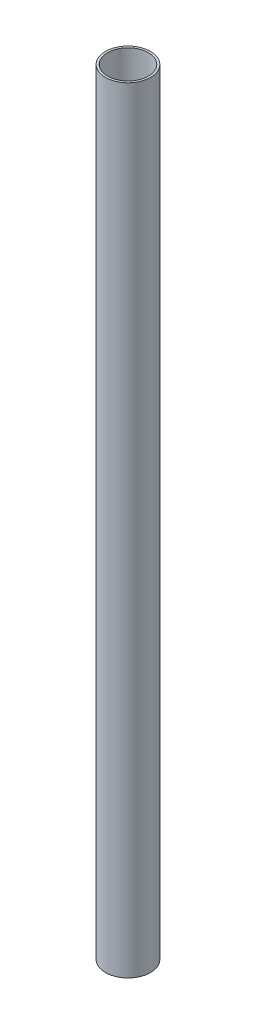
ISO-10303-21;
HEADER;
FILE_DESCRIPTION(('STEP AP214'),'2;1');
FILE_NAME('part.step','',(''),(''),'','','');
FILE_SCHEMA(('AUTOMOTIVE_DESIGN { 1 0 10303 214 1 1 1 1 }'));
ENDSEC;
DATA;
#1=APPLICATION_CONTEXT('core data for automotive mechanical design processes');
#2=APPLICATION_PROTOCOL_DEFINITION('international standard','automotive_design',2000,#1);
#3=PRODUCT_CONTEXT('',#1,'mechanical');
#4=PRODUCT('Part','Part','',(#3));
#5=PRODUCT_RELATED_PRODUCT_CATEGORY('part','',(#4));
#6=PRODUCT_DEFINITION_FORMATION('','',#4);
#7=PRODUCT_DEFINITION_CONTEXT('part definition',#1,'design');
#8=PRODUCT_DEFINITION('design','',#6,#7);
#9=PRODUCT_DEFINITION_SHAPE('','',#8);
#10=(LENGTH_UNIT() NAMED_UNIT(*) SI_UNIT(.MILLI.,.METRE.));
#11=(NAMED_UNIT(*) PLANE_ANGLE_UNIT() SI_UNIT($,.RADIAN.));
#12=(NAMED_UNIT(*) SI_UNIT($,.STERADIAN.) SOLID_ANGLE_UNIT());
#13=UNCERTAINTY_MEASURE_WITH_UNIT(LENGTH_MEASURE(1.E-05),#10,'distance_accuracy_value','');
#14=(GEOMETRIC_REPRESENTATION_CONTEXT(3) GLOBAL_UNCERTAINTY_ASSIGNED_CONTEXT((#13)) GLOBAL_UNIT_ASSIGNED_CONTEXT((#10,
#11,#12)) REPRESENTATION_CONTEXT('',''));
#15=CARTESIAN_POINT('',(0.,0.,0.));
#16=DIRECTION('',(0.,0.,1.));
#17=DIRECTION('',(1.,0.,0.));
#18=AXIS2_PLACEMENT_3D('',#15,#16,#17);
#19=CARTESIAN_POINT('',(0.,546.1,0.));
#20=DIRECTION('',(0.,1.,0.));
#21=DIRECTION('',(0.,0.,1.));
#22=AXIS2_PLACEMENT_3D('',#19,#20,#21);
#23=PLANE('',#22);
#24=CARTESIAN_POINT('',(0.,546.1,0.));
#25=DIRECTION('',(0.,1.,0.));
#26=DIRECTION('',(0.,0.,1.));
#27=AXIS2_PLACEMENT_3D('',#24,#25,#26);
#28=CIRCLE('',#27,15.875);
#29=CARTESIAN_POINT('',(0.,546.1,15.875));
#30=VERTEX_POINT('',#29);
#31=EDGE_CURVE('E11',#30,#30,#28,.T.);
#32=ORIENTED_EDGE('',*,*,#31,.T.);
#33=EDGE_LOOP('',(#32));
#34=FACE_BOUND('',#33,.T.);
#35=CARTESIAN_POINT('',(0.,546.1,0.));
#36=DIRECTION('',(0.,1.,0.));
#37=DIRECTION('',(0.,0.,1.));
#38=AXIS2_PLACEMENT_3D('',#35,#36,#37);
#39=CIRCLE('',#38,14.351);
#40=CARTESIAN_POINT('',(0.,546.1,14.351));
#41=VERTEX_POINT('',#40);
#42=EDGE_CURVE('E48',#41,#41,#39,.T.);
#43=ORIENTED_EDGE('',*,*,#42,.F.);
#44=EDGE_LOOP('',(#43));
#45=FACE_BOUND('',#44,.T.);
#46=ADVANCED_FACE('F37',(#34,#45),#23,.T.);
#47=CARTESIAN_POINT('',(0.,0.,0.));
#48=DIRECTION('',(0.,1.,0.));
#49=DIRECTION('',(0.,0.,1.));
#50=AXIS2_PLACEMENT_3D('',#47,#48,#49);
#51=PLANE('',#50);
#52=CARTESIAN_POINT('',(0.,0.,0.));
#53=DIRECTION('',(0.,1.,0.));
#54=DIRECTION('',(0.,0.,1.));
#55=AXIS2_PLACEMENT_3D('',#52,#53,#54);
#56=CIRCLE('',#55,15.875);
#57=CARTESIAN_POINT('',(0.,0.,15.875));
#58=VERTEX_POINT('',#57);
#59=EDGE_CURVE('E41',#58,#58,#56,.T.);
#60=ORIENTED_EDGE('',*,*,#59,.F.);
#61=EDGE_LOOP('',(#60));
#62=FACE_BOUND('',#61,.T.);
#63=CARTESIAN_POINT('',(0.,0.,0.));
#64=DIRECTION('',(0.,1.,0.));
#65=DIRECTION('',(0.,0.,1.));
#66=AXIS2_PLACEMENT_3D('',#63,#64,#65);
#67=CIRCLE('',#66,14.351);
#68=CARTESIAN_POINT('',(0.,0.,14.351));
#69=VERTEX_POINT('',#68);
#70=EDGE_CURVE('E50',#69,#69,#67,.T.);
#71=ORIENTED_EDGE('',*,*,#70,.T.);
#72=EDGE_LOOP('',(#71));
#73=FACE_BOUND('',#72,.T.);
#74=ADVANCED_FACE('F60',(#62,#73),#51,.F.);
#75=CARTESIAN_POINT('',(0.,546.1,0.));
#76=DIRECTION('',(0.,-1.,0.));
#77=DIRECTION('',(0.,0.,-1.));
#78=AXIS2_PLACEMENT_3D('',#75,#76,#77);
#79=CYLINDRICAL_SURFACE('',#78,15.875);
#80=ORIENTED_EDGE('',*,*,#31,.F.);
#81=EDGE_LOOP('',(#80));
#82=FACE_BOUND('',#81,.T.);
#83=ORIENTED_EDGE('',*,*,#59,.T.);
#84=EDGE_LOOP('',(#83));
#85=FACE_BOUND('',#84,.T.);
#86=ADVANCED_FACE('F39',(#82,#85),#79,.T.);
#87=CARTESIAN_POINT('',(0.,546.1,0.));
#88=DIRECTION('',(0.,-1.,0.));
#89=DIRECTION('',(0.,0.,-1.));
#90=AXIS2_PLACEMENT_3D('',#87,#88,#89);
#91=CYLINDRICAL_SURFACE('',#90,14.351);
#92=ORIENTED_EDGE('',*,*,#42,.T.);
#93=EDGE_LOOP('',(#92));
#94=FACE_BOUND('',#93,.T.);
#95=ORIENTED_EDGE('',*,*,#70,.F.);
#96=EDGE_LOOP('',(#95));
#97=FACE_BOUND('',#96,.T.);
#98=ADVANCED_FACE('F56',(#94,#97),#91,.F.);
#99=CLOSED_SHELL('',(#46,#74,#86,#98));
#100=MANIFOLD_SOLID_BREP('B2',#99);
#101=ADVANCED_BREP_SHAPE_REPRESENTATION('',(#18,#100),#14);
#102=SHAPE_DEFINITION_REPRESENTATION(#9,#101);
ENDSEC;
END-ISO-10303-21;
